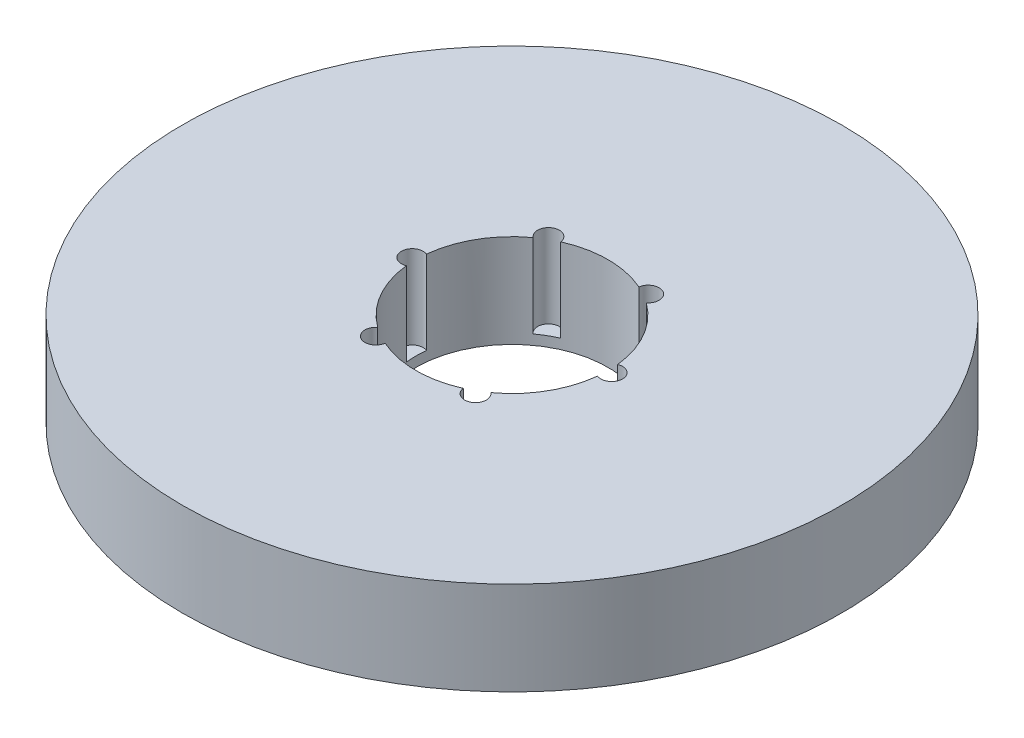
ISO-10303-21;
HEADER;
FILE_DESCRIPTION(('STEP AP214'),'2;1');
FILE_NAME('part.step','',(''),(''),'','','');
FILE_SCHEMA(('AUTOMOTIVE_DESIGN { 1 0 10303 214 1 1 1 1 }'));
ENDSEC;
DATA;
#1=APPLICATION_CONTEXT('core data for automotive mechanical design processes');
#2=APPLICATION_PROTOCOL_DEFINITION('international standard','automotive_design',2000,#1);
#3=PRODUCT_CONTEXT('',#1,'mechanical');
#4=PRODUCT('Part','Part','',(#3));
#5=PRODUCT_RELATED_PRODUCT_CATEGORY('part','',(#4));
#6=PRODUCT_DEFINITION_FORMATION('','',#4);
#7=PRODUCT_DEFINITION_CONTEXT('part definition',#1,'design');
#8=PRODUCT_DEFINITION('design','',#6,#7);
#9=PRODUCT_DEFINITION_SHAPE('','',#8);
#10=(LENGTH_UNIT() NAMED_UNIT(*) SI_UNIT(.MILLI.,.METRE.));
#11=(NAMED_UNIT(*) PLANE_ANGLE_UNIT() SI_UNIT($,.RADIAN.));
#12=(NAMED_UNIT(*) SI_UNIT($,.STERADIAN.) SOLID_ANGLE_UNIT());
#13=UNCERTAINTY_MEASURE_WITH_UNIT(LENGTH_MEASURE(1.E-05),#10,'distance_accuracy_value','');
#14=(GEOMETRIC_REPRESENTATION_CONTEXT(3) GLOBAL_UNCERTAINTY_ASSIGNED_CONTEXT((#13)) GLOBAL_UNIT_ASSIGNED_CONTEXT((#10,
#11,#12)) REPRESENTATION_CONTEXT('',''));
#15=CARTESIAN_POINT('',(0.,0.,0.));
#16=DIRECTION('',(0.,0.,1.));
#17=DIRECTION('',(1.,0.,0.));
#18=AXIS2_PLACEMENT_3D('',#15,#16,#17);
#19=CARTESIAN_POINT('',(0.,17.,0.));
#20=DIRECTION('',(0.,-1.,0.));
#21=DIRECTION('',(0.,0.,-1.));
#22=AXIS2_PLACEMENT_3D('',#19,#20,#21);
#23=CYLINDRICAL_SURFACE('',#22,60.);
#24=CARTESIAN_POINT('',(0.,17.,0.));
#25=DIRECTION('',(0.,1.,0.));
#26=DIRECTION('',(0.,0.,1.));
#27=AXIS2_PLACEMENT_3D('',#24,#25,#26);
#28=CIRCLE('',#27,60.);
#29=CARTESIAN_POINT('',(0.,17.,60.));
#30=VERTEX_POINT('',#29);
#31=EDGE_CURVE('E171',#30,#30,#28,.T.);
#32=ORIENTED_EDGE('',*,*,#31,.F.);
#33=EDGE_LOOP('',(#32));
#34=FACE_BOUND('',#33,.T.);
#35=CARTESIAN_POINT('',(0.,0.,0.));
#36=DIRECTION('',(0.,1.,0.));
#37=DIRECTION('',(0.,0.,1.));
#38=AXIS2_PLACEMENT_3D('',#35,#36,#37);
#39=CIRCLE('',#38,60.);
#40=CARTESIAN_POINT('',(0.,0.,60.));
#41=VERTEX_POINT('',#40);
#42=EDGE_CURVE('E157',#41,#41,#39,.T.);
#43=ORIENTED_EDGE('',*,*,#42,.T.);
#44=EDGE_LOOP('',(#43));
#45=FACE_BOUND('',#44,.T.);
#46=ADVANCED_FACE('F39',(#34,#45),#23,.T.);
#47=CARTESIAN_POINT('',(0.,17.,0.));
#48=DIRECTION('',(0.,1.,0.));
#49=DIRECTION('',(0.,0.,1.));
#50=AXIS2_PLACEMENT_3D('',#47,#48,#49);
#51=PLANE('',#50);
#52=CARTESIAN_POINT('',(-9.07714624385302,17.,-15.722078482086));
#53=DIRECTION('',(0.,1.,0.));
#54=DIRECTION('',(-0.866025403784433,0.,0.50000000000001));
#55=AXIS2_PLACEMENT_3D('',#52,#53,#54);
#56=CIRCLE('',#55,1.98122114280919);
#57=CARTESIAN_POINT('',(-7.1139602013793,17.,-15.9887951470144));
#58=VERTEX_POINT('',#57);
#59=CARTESIAN_POINT('',(-10.2897226725305,17.,-14.1552678294129));
#60=VERTEX_POINT('',#59);
#61=EDGE_CURVE('E214',#58,#60,#56,.T.);
#62=ORIENTED_EDGE('',*,*,#61,.F.);
#63=CARTESIAN_POINT('',(0.,17.,0.));
#64=DIRECTION('',(0.,1.,0.));
#65=DIRECTION('',(0.,0.,1.));
#66=AXIS2_PLACEMENT_3D('',#63,#64,#65);
#67=CIRCLE('',#66,17.5);
#68=CARTESIAN_POINT('',(7.11396020137896,17.,-15.9887951470146));
#69=VERTEX_POINT('',#68);
#70=EDGE_CURVE('E272',#69,#58,#67,.T.);
#71=ORIENTED_EDGE('',*,*,#70,.F.);
#72=CARTESIAN_POINT('',(9.07714624385269,17.,-15.7220784820862));
#73=DIRECTION('',(0.,1.,0.));
#74=DIRECTION('',(-0.866025403784443,0.,-0.499999999999992));
#75=AXIS2_PLACEMENT_3D('',#72,#73,#74);
#76=CIRCLE('',#75,1.98122114280919);
#77=CARTESIAN_POINT('',(10.2897226725302,17.,-14.1552678294131));
#78=VERTEX_POINT('',#77);
#79=EDGE_CURVE('E285',#78,#69,#76,.T.);
#80=ORIENTED_EDGE('',*,*,#79,.F.);
#81=CARTESIAN_POINT('',(17.4036828739095,17.,-1.83352731760148));
#82=VERTEX_POINT('',#81);
#83=EDGE_CURVE('E165',#82,#78,#67,.T.);
#84=ORIENTED_EDGE('',*,*,#83,.F.);
#85=CARTESIAN_POINT('',(18.1542924877057,17.,0.));
#86=DIRECTION('',(0.,1.,0.));
#87=DIRECTION('',(0.,0.,-1.));
#88=AXIS2_PLACEMENT_3D('',#85,#86,#87);
#89=CIRCLE('',#88,1.98122114280919);
#90=CARTESIAN_POINT('',(17.4036828739095,17.,1.83352731760148));
#91=VERTEX_POINT('',#90);
#92=EDGE_CURVE('E281',#91,#82,#89,.T.);
#93=ORIENTED_EDGE('',*,*,#92,.F.);
#94=CARTESIAN_POINT('',(10.2897226725304,17.,14.155267829413));
#95=VERTEX_POINT('',#94);
#96=EDGE_CURVE('E160',#95,#91,#67,.T.);
#97=ORIENTED_EDGE('',*,*,#96,.F.);
#98=CARTESIAN_POINT('',(9.07714624385291,17.,15.7220784820861));
#99=DIRECTION('',(0.,1.,0.));
#100=DIRECTION('',(0.866025403784436,0.,-0.500000000000004));
#101=AXIS2_PLACEMENT_3D('',#98,#99,#100);
#102=CIRCLE('',#101,1.98122114280919);
#103=CARTESIAN_POINT('',(7.11396020137918,17.,15.9887951470145));
#104=VERTEX_POINT('',#103);
#105=EDGE_CURVE('E154',#104,#95,#102,.T.);
#106=ORIENTED_EDGE('',*,*,#105,.F.);
#107=CARTESIAN_POINT('',(-7.11396020137907,17.,15.9887951470145));
#108=VERTEX_POINT('',#107);
#109=EDGE_CURVE('E150',#108,#104,#67,.T.);
#110=ORIENTED_EDGE('',*,*,#109,.F.);
#111=CARTESIAN_POINT('',(-9.0771462438528,17.,15.7220784820861));
#112=DIRECTION('',(0.,1.,0.));
#113=DIRECTION('',(0.86602540378444,0.,0.499999999999998));
#114=AXIS2_PLACEMENT_3D('',#111,#112,#113);
#115=CIRCLE('',#114,1.98122114280919);
#116=CARTESIAN_POINT('',(-10.2897226725303,17.,14.155267829413));
#117=VERTEX_POINT('',#116);
#118=EDGE_CURVE('E127',#117,#108,#115,.T.);
#119=ORIENTED_EDGE('',*,*,#118,.F.);
#120=CARTESIAN_POINT('',(-17.4036828739095,17.,1.83352731760148));
#121=VERTEX_POINT('',#120);
#122=EDGE_CURVE('E156',#121,#117,#67,.T.);
#123=ORIENTED_EDGE('',*,*,#122,.F.);
#124=CARTESIAN_POINT('',(-18.1542924877057,17.,0.));
#125=DIRECTION('',(0.,1.,0.));
#126=DIRECTION('',(0.,0.,1.));
#127=AXIS2_PLACEMENT_3D('',#124,#125,#126);
#128=CIRCLE('',#127,1.98122114280919);
#129=CARTESIAN_POINT('',(-17.4036828739095,17.,-1.83352731760148));
#130=VERTEX_POINT('',#129);
#131=EDGE_CURVE('E164',#130,#121,#128,.T.);
#132=ORIENTED_EDGE('',*,*,#131,.F.);
#133=EDGE_CURVE('E159',#60,#130,#67,.T.);
#134=ORIENTED_EDGE('',*,*,#133,.F.);
#135=EDGE_LOOP('',(#62,#71,#80,#84,#93,#97,#106,#110,#119,#123,#132,#134));
#136=FACE_BOUND('',#135,.T.);
#137=ORIENTED_EDGE('',*,*,#31,.T.);
#138=EDGE_LOOP('',(#137));
#139=FACE_BOUND('',#138,.T.);
#140=ADVANCED_FACE('F155',(#136,#139),#51,.T.);
#141=CARTESIAN_POINT('',(0.,0.,0.));
#142=DIRECTION('',(0.,1.,0.));
#143=DIRECTION('',(0.,0.,1.));
#144=AXIS2_PLACEMENT_3D('',#141,#142,#143);
#145=PLANE('',#144);
#146=CARTESIAN_POINT('',(0.,0.,0.));
#147=DIRECTION('',(0.,1.,0.));
#148=DIRECTION('',(0.,0.,1.));
#149=AXIS2_PLACEMENT_3D('',#146,#147,#148);
#150=CIRCLE('',#149,17.5);
#151=CARTESIAN_POINT('',(0.,0.,17.5));
#152=VERTEX_POINT('',#151);
#153=EDGE_CURVE('E170',#152,#152,#150,.T.);
#154=ORIENTED_EDGE('',*,*,#153,.T.);
#155=EDGE_LOOP('',(#154));
#156=FACE_BOUND('',#155,.T.);
#157=ORIENTED_EDGE('',*,*,#42,.F.);
#158=EDGE_LOOP('',(#157));
#159=FACE_BOUND('',#158,.T.);
#160=ADVANCED_FACE('F232',(#156,#159),#145,.F.);
#161=CARTESIAN_POINT('',(0.,17.,0.));
#162=DIRECTION('',(0.,-1.,0.));
#163=DIRECTION('',(0.,0.,-1.));
#164=AXIS2_PLACEMENT_3D('',#161,#162,#163);
#165=CYLINDRICAL_SURFACE('',#164,17.5);
#166=DIRECTION('',(0.,1.,0.));
#167=VECTOR('',#166,1.);
#168=CARTESIAN_POINT('',(-7.1139602013793,9.40317073220903,-15.9887951470144));
#169=LINE('',#168,#167);
#170=CARTESIAN_POINT('',(-7.1139602013793,1.80634146441805,-15.9887951470144));
#171=VERTEX_POINT('',#170);
#172=EDGE_CURVE('E11',#171,#58,#169,.T.);
#173=ORIENTED_EDGE('',*,*,#172,.F.);
#174=CARTESIAN_POINT('',(0.,1.80634146441805,0.));
#175=DIRECTION('',(0.,1.,0.));
#176=DIRECTION('',(0.,0.,1.));
#177=AXIS2_PLACEMENT_3D('',#174,#175,#176);
#178=CIRCLE('',#177,17.5);
#179=CARTESIAN_POINT('',(-10.2897226725305,1.80634146441805,-14.1552678294129));
#180=VERTEX_POINT('',#179);
#181=EDGE_CURVE('E209',#171,#180,#178,.T.);
#182=ORIENTED_EDGE('',*,*,#181,.T.);
#183=DIRECTION('',(0.,1.,0.));
#184=VECTOR('',#183,1.);
#185=CARTESIAN_POINT('',(-10.2897226725305,9.40317073220903,-14.1552678294129));
#186=LINE('',#185,#184);
#187=EDGE_CURVE('E46',#60,#180,#186,.F.);
#188=ORIENTED_EDGE('',*,*,#187,.F.);
#189=ORIENTED_EDGE('',*,*,#133,.T.);
#190=DIRECTION('',(0.,1.,0.));
#191=VECTOR('',#190,1.);
#192=CARTESIAN_POINT('',(-17.4036828739095,9.40317073220903,-1.83352731760148));
#193=LINE('',#192,#191);
#194=CARTESIAN_POINT('',(-17.4036828739095,1.80634146441805,-1.83352731760148));
#195=VERTEX_POINT('',#194);
#196=EDGE_CURVE('E185',#195,#130,#193,.T.);
#197=ORIENTED_EDGE('',*,*,#196,.F.);
#198=CARTESIAN_POINT('',(0.,1.80634146441805,0.));
#199=DIRECTION('',(0.,1.,0.));
#200=DIRECTION('',(0.,0.,1.));
#201=AXIS2_PLACEMENT_3D('',#198,#199,#200);
#202=CIRCLE('',#201,17.5);
#203=CARTESIAN_POINT('',(-17.4036828739095,1.80634146441805,1.83352731760148));
#204=VERTEX_POINT('',#203);
#205=EDGE_CURVE('E173',#195,#204,#202,.T.);
#206=ORIENTED_EDGE('',*,*,#205,.T.);
#207=DIRECTION('',(0.,1.,0.));
#208=VECTOR('',#207,1.);
#209=CARTESIAN_POINT('',(-17.4036828739095,9.40317073220903,1.83352731760148));
#210=LINE('',#209,#208);
#211=EDGE_CURVE('E178',#121,#204,#210,.F.);
#212=ORIENTED_EDGE('',*,*,#211,.F.);
#213=ORIENTED_EDGE('',*,*,#122,.T.);
#214=DIRECTION('',(0.,1.,0.));
#215=VECTOR('',#214,1.);
#216=CARTESIAN_POINT('',(-10.2897226725303,9.40317073220903,14.155267829413));
#217=LINE('',#216,#215);
#218=CARTESIAN_POINT('',(-10.2897226725303,1.80634146441805,14.155267829413));
#219=VERTEX_POINT('',#218);
#220=EDGE_CURVE('E132',#219,#117,#217,.T.);
#221=ORIENTED_EDGE('',*,*,#220,.F.);
#222=CARTESIAN_POINT('',(0.,1.80634146441805,0.));
#223=DIRECTION('',(0.,1.,0.));
#224=DIRECTION('',(0.,0.,1.));
#225=AXIS2_PLACEMENT_3D('',#222,#223,#224);
#226=CIRCLE('',#225,17.5);
#227=CARTESIAN_POINT('',(-7.11396020137907,1.80634146441805,15.9887951470145));
#228=VERTEX_POINT('',#227);
#229=EDGE_CURVE('E146',#219,#228,#226,.T.);
#230=ORIENTED_EDGE('',*,*,#229,.T.);
#231=DIRECTION('',(0.,1.,0.));
#232=VECTOR('',#231,1.);
#233=CARTESIAN_POINT('',(-7.11396020137907,9.40317073220903,15.9887951470145));
#234=LINE('',#233,#232);
#235=EDGE_CURVE('E128',#108,#228,#234,.F.);
#236=ORIENTED_EDGE('',*,*,#235,.F.);
#237=ORIENTED_EDGE('',*,*,#109,.T.);
#238=DIRECTION('',(0.,1.,0.));
#239=VECTOR('',#238,1.);
#240=CARTESIAN_POINT('',(7.11396020137918,9.40317073220903,15.9887951470145));
#241=LINE('',#240,#239);
#242=CARTESIAN_POINT('',(7.11396020137918,1.80634146441805,15.9887951470145));
#243=VERTEX_POINT('',#242);
#244=EDGE_CURVE('E192',#243,#104,#241,.T.);
#245=ORIENTED_EDGE('',*,*,#244,.F.);
#246=CARTESIAN_POINT('',(0.,1.80634146441805,0.));
#247=DIRECTION('',(0.,1.,0.));
#248=DIRECTION('',(0.,0.,1.));
#249=AXIS2_PLACEMENT_3D('',#246,#247,#248);
#250=CIRCLE('',#249,17.5);
#251=CARTESIAN_POINT('',(10.2897226725304,1.80634146441805,14.155267829413));
#252=VERTEX_POINT('',#251);
#253=EDGE_CURVE('E190',#243,#252,#250,.T.);
#254=ORIENTED_EDGE('',*,*,#253,.T.);
#255=DIRECTION('',(0.,1.,0.));
#256=VECTOR('',#255,1.);
#257=CARTESIAN_POINT('',(10.2897226725304,9.40317073220903,14.155267829413));
#258=LINE('',#257,#256);
#259=EDGE_CURVE('E189',#95,#252,#258,.F.);
#260=ORIENTED_EDGE('',*,*,#259,.F.);
#261=ORIENTED_EDGE('',*,*,#96,.T.);
#262=DIRECTION('',(0.,1.,0.));
#263=VECTOR('',#262,1.);
#264=CARTESIAN_POINT('',(17.4036828739095,9.40317073220903,1.83352731760148));
#265=LINE('',#264,#263);
#266=CARTESIAN_POINT('',(17.4036828739095,1.80634146441805,1.83352731760148));
#267=VERTEX_POINT('',#266);
#268=EDGE_CURVE('E203',#267,#91,#265,.T.);
#269=ORIENTED_EDGE('',*,*,#268,.F.);
#270=CARTESIAN_POINT('',(0.,1.80634146441805,0.));
#271=DIRECTION('',(0.,1.,0.));
#272=DIRECTION('',(0.,0.,1.));
#273=AXIS2_PLACEMENT_3D('',#270,#271,#272);
#274=CIRCLE('',#273,17.5);
#275=CARTESIAN_POINT('',(17.4036828739095,1.80634146441805,-1.83352731760148));
#276=VERTEX_POINT('',#275);
#277=EDGE_CURVE('E194',#267,#276,#274,.T.);
#278=ORIENTED_EDGE('',*,*,#277,.T.);
#279=DIRECTION('',(0.,1.,0.));
#280=VECTOR('',#279,1.);
#281=CARTESIAN_POINT('',(17.4036828739095,9.40317073220903,-1.83352731760148));
#282=LINE('',#281,#280);
#283=EDGE_CURVE('E196',#82,#276,#282,.F.);
#284=ORIENTED_EDGE('',*,*,#283,.F.);
#285=ORIENTED_EDGE('',*,*,#83,.T.);
#286=DIRECTION('',(0.,1.,0.));
#287=VECTOR('',#286,1.);
#288=CARTESIAN_POINT('',(10.2897226725302,9.40317073220903,-14.1552678294131));
#289=LINE('',#288,#287);
#290=CARTESIAN_POINT('',(10.2897226725302,1.80634146441805,-14.1552678294131));
#291=VERTEX_POINT('',#290);
#292=EDGE_CURVE('E208',#291,#78,#289,.T.);
#293=ORIENTED_EDGE('',*,*,#292,.F.);
#294=CARTESIAN_POINT('',(0.,1.80634146441805,0.));
#295=DIRECTION('',(0.,1.,0.));
#296=DIRECTION('',(0.,0.,1.));
#297=AXIS2_PLACEMENT_3D('',#294,#295,#296);
#298=CIRCLE('',#297,17.5);
#299=CARTESIAN_POINT('',(7.11396020137896,1.80634146441805,-15.9887951470146));
#300=VERTEX_POINT('',#299);
#301=EDGE_CURVE('E201',#291,#300,#298,.T.);
#302=ORIENTED_EDGE('',*,*,#301,.T.);
#303=DIRECTION('',(0.,1.,0.));
#304=VECTOR('',#303,1.);
#305=CARTESIAN_POINT('',(7.11396020137896,9.40317073220903,-15.9887951470146));
#306=LINE('',#305,#304);
#307=EDGE_CURVE('E206',#69,#300,#306,.F.);
#308=ORIENTED_EDGE('',*,*,#307,.F.);
#309=ORIENTED_EDGE('',*,*,#70,.T.);
#310=EDGE_LOOP('',(#173,#182,#188,#189,#197,#206,#212,#213,#221,#230,#236,#237,#245,#254,#260,
#261,#269,#278,#284,#285,#293,#302,#308,#309));
#311=FACE_BOUND('',#310,.T.);
#312=ORIENTED_EDGE('',*,*,#153,.F.);
#313=EDGE_LOOP('',(#312));
#314=FACE_BOUND('',#313,.T.);
#315=ADVANCED_FACE('F145',(#311,#314),#165,.F.);
#316=CARTESIAN_POINT('',(-18.1542924877057,1.80634146441805,0.));
#317=DIRECTION('',(0.,1.,0.));
#318=DIRECTION('',(0.,0.,1.));
#319=AXIS2_PLACEMENT_3D('',#316,#317,#318);
#320=CYLINDRICAL_SURFACE('',#319,1.98122114280919);
#321=ORIENTED_EDGE('',*,*,#196,.T.);
#322=ORIENTED_EDGE('',*,*,#131,.T.);
#323=ORIENTED_EDGE('',*,*,#211,.T.);
#324=CARTESIAN_POINT('',(-18.1542924877057,1.80634146441805,0.));
#325=DIRECTION('',(0.,1.,0.));
#326=DIRECTION('',(0.,0.,1.));
#327=AXIS2_PLACEMENT_3D('',#324,#325,#326);
#328=CIRCLE('',#327,1.98122114280919);
#329=EDGE_CURVE('E168',#195,#204,#328,.T.);
#330=ORIENTED_EDGE('',*,*,#329,.F.);
#331=EDGE_LOOP('',(#321,#322,#323,#330));
#332=FACE_BOUND('',#331,.T.);
#333=ADVANCED_FACE('F243',(#332),#320,.F.);
#334=CARTESIAN_POINT('',(-18.1542924877057,1.80634146441805,0.));
#335=DIRECTION('',(0.,1.,0.));
#336=DIRECTION('',(0.,0.,1.));
#337=AXIS2_PLACEMENT_3D('',#334,#335,#336);
#338=PLANE('',#337);
#339=ORIENTED_EDGE('',*,*,#329,.T.);
#340=ORIENTED_EDGE('',*,*,#205,.F.);
#341=EDGE_LOOP('',(#339,#340));
#342=FACE_BOUND('',#341,.T.);
#343=ADVANCED_FACE('F247',(#342),#338,.T.);
#344=CARTESIAN_POINT('',(-9.0771462438528,1.80634146441805,15.7220784820861));
#345=DIRECTION('',(0.,1.,0.));
#346=DIRECTION('',(0.,0.,1.));
#347=AXIS2_PLACEMENT_3D('',#344,#345,#346);
#348=CYLINDRICAL_SURFACE('',#347,1.98122114280919);
#349=ORIENTED_EDGE('',*,*,#220,.T.);
#350=ORIENTED_EDGE('',*,*,#118,.T.);
#351=ORIENTED_EDGE('',*,*,#235,.T.);
#352=CARTESIAN_POINT('',(-9.0771462438528,1.80634146441805,15.7220784820861));
#353=DIRECTION('',(0.,1.,0.));
#354=DIRECTION('',(0.86602540378444,0.,0.499999999999998));
#355=AXIS2_PLACEMENT_3D('',#352,#353,#354);
#356=CIRCLE('',#355,1.98122114280919);
#357=EDGE_CURVE('E137',#219,#228,#356,.T.);
#358=ORIENTED_EDGE('',*,*,#357,.F.);
#359=EDGE_LOOP('',(#349,#350,#351,#358));
#360=FACE_BOUND('',#359,.T.);
#361=ADVANCED_FACE('F126',(#360),#348,.F.);
#362=CARTESIAN_POINT('',(-9.0771462438528,1.80634146441805,15.7220784820861));
#363=DIRECTION('',(0.,1.,0.));
#364=DIRECTION('',(0.86602540378444,0.,0.499999999999998));
#365=AXIS2_PLACEMENT_3D('',#362,#363,#364);
#366=PLANE('',#365);
#367=ORIENTED_EDGE('',*,*,#357,.T.);
#368=ORIENTED_EDGE('',*,*,#229,.F.);
#369=EDGE_LOOP('',(#367,#368));
#370=FACE_BOUND('',#369,.T.);
#371=ADVANCED_FACE('F254',(#370),#366,.T.);
#372=CARTESIAN_POINT('',(9.07714624385291,1.80634146441805,15.7220784820861));
#373=DIRECTION('',(0.,1.,0.));
#374=DIRECTION('',(0.,0.,1.));
#375=AXIS2_PLACEMENT_3D('',#372,#373,#374);
#376=CYLINDRICAL_SURFACE('',#375,1.98122114280919);
#377=ORIENTED_EDGE('',*,*,#244,.T.);
#378=ORIENTED_EDGE('',*,*,#105,.T.);
#379=ORIENTED_EDGE('',*,*,#259,.T.);
#380=CARTESIAN_POINT('',(9.07714624385291,1.80634146441805,15.7220784820861));
#381=DIRECTION('',(0.,1.,0.));
#382=DIRECTION('',(0.866025403784436,0.,-0.500000000000004));
#383=AXIS2_PLACEMENT_3D('',#380,#381,#382);
#384=CIRCLE('',#383,1.98122114280919);
#385=EDGE_CURVE('E138',#243,#252,#384,.T.);
#386=ORIENTED_EDGE('',*,*,#385,.F.);
#387=EDGE_LOOP('',(#377,#378,#379,#386));
#388=FACE_BOUND('',#387,.T.);
#389=ADVANCED_FACE('F260',(#388),#376,.F.);
#390=CARTESIAN_POINT('',(9.07714624385291,1.80634146441805,15.7220784820861));
#391=DIRECTION('',(0.,1.,0.));
#392=DIRECTION('',(0.866025403784436,0.,-0.500000000000004));
#393=AXIS2_PLACEMENT_3D('',#390,#391,#392);
#394=PLANE('',#393);
#395=ORIENTED_EDGE('',*,*,#385,.T.);
#396=ORIENTED_EDGE('',*,*,#253,.F.);
#397=EDGE_LOOP('',(#395,#396));
#398=FACE_BOUND('',#397,.T.);
#399=ADVANCED_FACE('F265',(#398),#394,.T.);
#400=CARTESIAN_POINT('',(18.1542924877057,1.80634146441805,0.));
#401=DIRECTION('',(0.,1.,0.));
#402=DIRECTION('',(0.,0.,1.));
#403=AXIS2_PLACEMENT_3D('',#400,#401,#402);
#404=CYLINDRICAL_SURFACE('',#403,1.98122114280919);
#405=ORIENTED_EDGE('',*,*,#268,.T.);
#406=ORIENTED_EDGE('',*,*,#92,.T.);
#407=ORIENTED_EDGE('',*,*,#283,.T.);
#408=CARTESIAN_POINT('',(18.1542924877057,1.80634146441805,0.));
#409=DIRECTION('',(0.,1.,0.));
#410=DIRECTION('',(0.,0.,-1.));
#411=AXIS2_PLACEMENT_3D('',#408,#409,#410);
#412=CIRCLE('',#411,1.98122114280919);
#413=EDGE_CURVE('E287',#267,#276,#412,.T.);
#414=ORIENTED_EDGE('',*,*,#413,.F.);
#415=EDGE_LOOP('',(#405,#406,#407,#414));
#416=FACE_BOUND('',#415,.T.);
#417=ADVANCED_FACE('F300',(#416),#404,.F.);
#418=CARTESIAN_POINT('',(18.1542924877057,1.80634146441805,0.));
#419=DIRECTION('',(0.,1.,0.));
#420=DIRECTION('',(0.,0.,-1.));
#421=AXIS2_PLACEMENT_3D('',#418,#419,#420);
#422=PLANE('',#421);
#423=ORIENTED_EDGE('',*,*,#413,.T.);
#424=ORIENTED_EDGE('',*,*,#277,.F.);
#425=EDGE_LOOP('',(#423,#424));
#426=FACE_BOUND('',#425,.T.);
#427=ADVANCED_FACE('F298',(#426),#422,.T.);
#428=CARTESIAN_POINT('',(9.07714624385269,1.80634146441805,-15.7220784820862));
#429=DIRECTION('',(0.,1.,0.));
#430=DIRECTION('',(0.,0.,1.));
#431=AXIS2_PLACEMENT_3D('',#428,#429,#430);
#432=CYLINDRICAL_SURFACE('',#431,1.98122114280919);
#433=ORIENTED_EDGE('',*,*,#292,.T.);
#434=ORIENTED_EDGE('',*,*,#79,.T.);
#435=ORIENTED_EDGE('',*,*,#307,.T.);
#436=CARTESIAN_POINT('',(9.07714624385269,1.80634146441805,-15.7220784820862));
#437=DIRECTION('',(0.,1.,0.));
#438=DIRECTION('',(-0.866025403784443,0.,-0.499999999999992));
#439=AXIS2_PLACEMENT_3D('',#436,#437,#438);
#440=CIRCLE('',#439,1.98122114280919);
#441=EDGE_CURVE('E56',#291,#300,#440,.T.);
#442=ORIENTED_EDGE('',*,*,#441,.F.);
#443=EDGE_LOOP('',(#433,#434,#435,#442));
#444=FACE_BOUND('',#443,.T.);
#445=ADVANCED_FACE('F301',(#444),#432,.F.);
#446=CARTESIAN_POINT('',(9.07714624385269,1.80634146441805,-15.7220784820862));
#447=DIRECTION('',(0.,1.,0.));
#448=DIRECTION('',(-0.866025403784443,0.,-0.499999999999992));
#449=AXIS2_PLACEMENT_3D('',#446,#447,#448);
#450=PLANE('',#449);
#451=ORIENTED_EDGE('',*,*,#441,.T.);
#452=ORIENTED_EDGE('',*,*,#301,.F.);
#453=EDGE_LOOP('',(#451,#452));
#454=FACE_BOUND('',#453,.T.);
#455=ADVANCED_FACE('F221',(#454),#450,.T.);
#456=CARTESIAN_POINT('',(-9.07714624385302,1.80634146441805,-15.722078482086));
#457=DIRECTION('',(0.,1.,0.));
#458=DIRECTION('',(0.,0.,1.));
#459=AXIS2_PLACEMENT_3D('',#456,#457,#458);
#460=CYLINDRICAL_SURFACE('',#459,1.98122114280919);
#461=ORIENTED_EDGE('',*,*,#172,.T.);
#462=ORIENTED_EDGE('',*,*,#61,.T.);
#463=ORIENTED_EDGE('',*,*,#187,.T.);
#464=CARTESIAN_POINT('',(-9.07714624385302,1.80634146441805,-15.722078482086));
#465=DIRECTION('',(0.,1.,0.));
#466=DIRECTION('',(-0.866025403784433,0.,0.50000000000001));
#467=AXIS2_PLACEMENT_3D('',#464,#465,#466);
#468=CIRCLE('',#467,1.98122114280919);
#469=EDGE_CURVE('E55',#171,#180,#468,.T.);
#470=ORIENTED_EDGE('',*,*,#469,.F.);
#471=EDGE_LOOP('',(#461,#462,#463,#470));
#472=FACE_BOUND('',#471,.T.);
#473=ADVANCED_FACE('F212',(#472),#460,.F.);
#474=CARTESIAN_POINT('',(-9.07714624385302,1.80634146441805,-15.722078482086));
#475=DIRECTION('',(0.,1.,0.));
#476=DIRECTION('',(-0.866025403784433,0.,0.50000000000001));
#477=AXIS2_PLACEMENT_3D('',#474,#475,#476);
#478=PLANE('',#477);
#479=ORIENTED_EDGE('',*,*,#469,.T.);
#480=ORIENTED_EDGE('',*,*,#181,.F.);
#481=EDGE_LOOP('',(#479,#480));
#482=FACE_BOUND('',#481,.T.);
#483=ADVANCED_FACE('F217',(#482),#478,.T.);
#484=CLOSED_SHELL('',(#46,#140,#160,#315,#333,#343,#361,#371,#389,#399,#417,#427,#445,#455,#473,#483));
#485=MANIFOLD_SOLID_BREP('B2',#484);
#486=ADVANCED_BREP_SHAPE_REPRESENTATION('',(#18,#485),#14);
#487=SHAPE_DEFINITION_REPRESENTATION(#9,#486);
ENDSEC;
END-ISO-10303-21;
